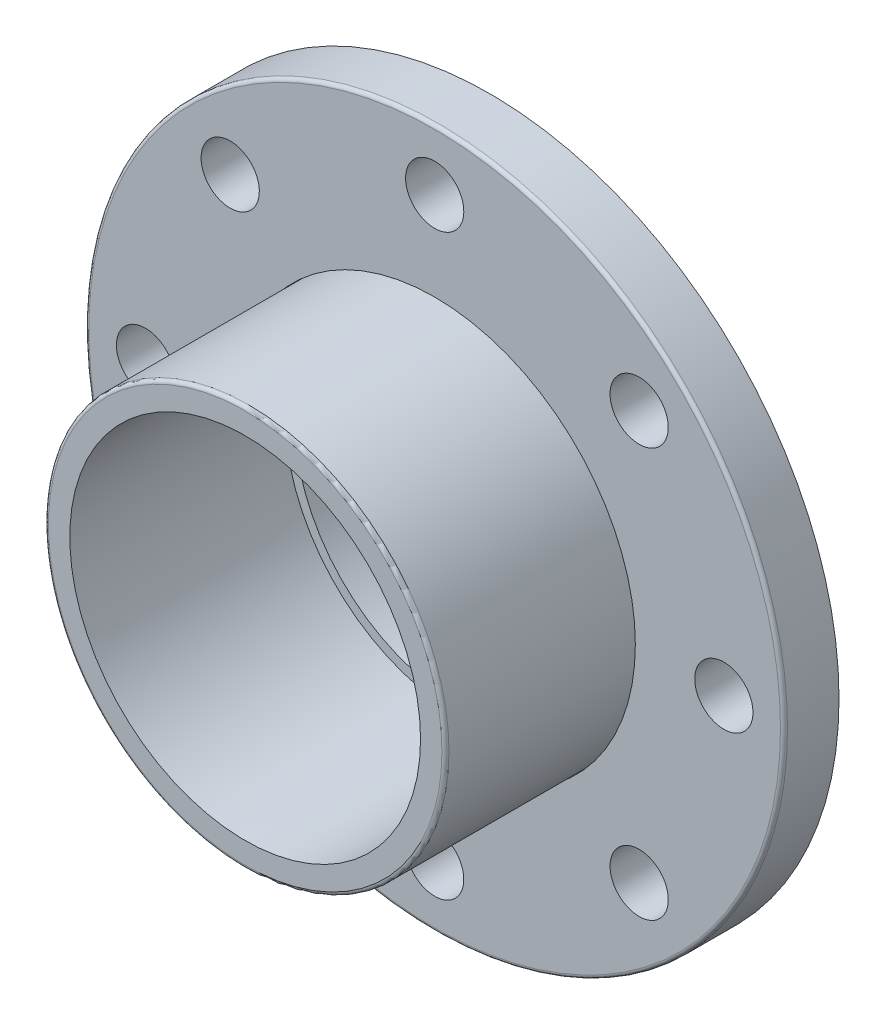
ISO-10303-21;
HEADER;
FILE_DESCRIPTION(('STEP AP214'),'2;1');
FILE_NAME('part.step','',(''),(''),'','','');
FILE_SCHEMA(('AUTOMOTIVE_DESIGN { 1 0 10303 214 1 1 1 1 }'));
ENDSEC;
DATA;
#1=APPLICATION_CONTEXT('core data for automotive mechanical design processes');
#2=APPLICATION_PROTOCOL_DEFINITION('international standard','automotive_design',2000,#1);
#3=PRODUCT_CONTEXT('',#1,'mechanical');
#4=PRODUCT('Part','Part','',(#3));
#5=PRODUCT_RELATED_PRODUCT_CATEGORY('part','',(#4));
#6=PRODUCT_DEFINITION_FORMATION('','',#4);
#7=PRODUCT_DEFINITION_CONTEXT('part definition',#1,'design');
#8=PRODUCT_DEFINITION('design','',#6,#7);
#9=PRODUCT_DEFINITION_SHAPE('','',#8);
#10=(LENGTH_UNIT() NAMED_UNIT(*) SI_UNIT(.MILLI.,.METRE.));
#11=(NAMED_UNIT(*) PLANE_ANGLE_UNIT() SI_UNIT($,.RADIAN.));
#12=(NAMED_UNIT(*) SI_UNIT($,.STERADIAN.) SOLID_ANGLE_UNIT());
#13=UNCERTAINTY_MEASURE_WITH_UNIT(LENGTH_MEASURE(1.E-05),#10,'distance_accuracy_value','');
#14=(GEOMETRIC_REPRESENTATION_CONTEXT(3) GLOBAL_UNCERTAINTY_ASSIGNED_CONTEXT((#13)) GLOBAL_UNIT_ASSIGNED_CONTEXT((#10,
#11,#12)) REPRESENTATION_CONTEXT('',''));
#15=CARTESIAN_POINT('',(0.,0.,0.));
#16=DIRECTION('',(0.,0.,1.));
#17=DIRECTION('',(1.,0.,0.));
#18=AXIS2_PLACEMENT_3D('',#15,#16,#17);
#19=CARTESIAN_POINT('',(0.,0.,0.));
#20=DIRECTION('',(0.,0.,-1.));
#21=DIRECTION('',(0.,1.,0.));
#22=AXIS2_PLACEMENT_3D('',#19,#20,#21);
#23=CYLINDRICAL_SURFACE('',#22,65.659);
#24=CARTESIAN_POINT('',(0.,0.,8.54972727272725));
#25=DIRECTION('',(0.,0.,-1.));
#26=DIRECTION('',(0.,1.,0.));
#27=AXIS2_PLACEMENT_3D('',#24,#25,#26);
#28=CIRCLE('',#27,65.659);
#29=CARTESIAN_POINT('',(0.,65.659,8.54972727272727));
#30=VERTEX_POINT('',#29);
#31=EDGE_CURVE('E65',#30,#30,#28,.T.);
#32=ORIENTED_EDGE('',*,*,#31,.T.);
#33=EDGE_LOOP('',(#32));
#34=FACE_BOUND('',#33,.T.);
#35=CARTESIAN_POINT('',(0.,0.,18.));
#36=DIRECTION('',(0.,0.,-1.));
#37=DIRECTION('',(0.,1.,0.));
#38=AXIS2_PLACEMENT_3D('',#35,#36,#37);
#39=CIRCLE('',#38,65.659);
#40=CARTESIAN_POINT('',(0.,65.659,18.));
#41=VERTEX_POINT('',#40);
#42=EDGE_CURVE('E60',#41,#41,#39,.T.);
#43=ORIENTED_EDGE('',*,*,#42,.F.);
#44=EDGE_LOOP('',(#43));
#45=FACE_BOUND('',#44,.T.);
#46=ADVANCED_FACE('F42',(#34,#45),#23,.F.);
#47=CARTESIAN_POINT('',(0.,65.532,8.54972727272727));
#48=DIRECTION('',(0.,0.,-1.));
#49=DIRECTION('',(0.,1.,0.));
#50=AXIS2_PLACEMENT_3D('',#47,#48,#49);
#51=PLANE('',#50);
#52=CARTESIAN_POINT('',(0.,0.,8.54972727272725));
#53=DIRECTION('',(0.,0.,-1.));
#54=DIRECTION('',(0.,1.,0.));
#55=AXIS2_PLACEMENT_3D('',#52,#53,#54);
#56=CIRCLE('',#55,75.057);
#57=CARTESIAN_POINT('',(0.,75.057,8.54972727272727));
#58=VERTEX_POINT('',#57);
#59=EDGE_CURVE('E67',#58,#58,#56,.T.);
#60=ORIENTED_EDGE('',*,*,#59,.T.);
#61=EDGE_LOOP('',(#60));
#62=FACE_BOUND('',#61,.T.);
#63=ORIENTED_EDGE('',*,*,#31,.F.);
#64=EDGE_LOOP('',(#63));
#65=FACE_BOUND('',#64,.T.);
#66=ADVANCED_FACE('F147',(#62,#65),#51,.T.);
#67=CARTESIAN_POINT('',(0.,0.,0.));
#68=DIRECTION('',(0.,0.,-1.));
#69=DIRECTION('',(0.,1.,0.));
#70=AXIS2_PLACEMENT_3D('',#67,#68,#69);
#71=CYLINDRICAL_SURFACE('',#70,75.057);
#72=CARTESIAN_POINT('',(0.,0.,0.));
#73=DIRECTION('',(0.,0.,-1.));
#74=DIRECTION('',(0.,1.,0.));
#75=AXIS2_PLACEMENT_3D('',#72,#73,#74);
#76=CIRCLE('',#75,75.057);
#77=CARTESIAN_POINT('',(0.,75.057,0.));
#78=VERTEX_POINT('',#77);
#79=EDGE_CURVE('E46',#78,#78,#76,.T.);
#80=ORIENTED_EDGE('',*,*,#79,.T.);
#81=EDGE_LOOP('',(#80));
#82=FACE_BOUND('',#81,.T.);
#83=ORIENTED_EDGE('',*,*,#59,.F.);
#84=EDGE_LOOP('',(#83));
#85=FACE_BOUND('',#84,.T.);
#86=ADVANCED_FACE('F133',(#82,#85),#71,.F.);
#87=CARTESIAN_POINT('',(0.,0.,16.8454545454545));
#88=DIRECTION('',(0.,0.,1.));
#89=DIRECTION('',(1.,0.,0.));
#90=AXIS2_PLACEMENT_3D('',#87,#88,#89);
#91=TOROIDAL_SURFACE('',#90,113.145454545455,1.15454545454545);
#92=CARTESIAN_POINT('',(0.,0.,16.8454545454545));
#93=DIRECTION('',(0.,0.,1.));
#94=DIRECTION('',(1.,0.,0.));
#95=AXIS2_PLACEMENT_3D('',#92,#93,#94);
#96=CIRCLE('',#95,114.3);
#97=CARTESIAN_POINT('',(114.3,0.,16.8454545454545));
#98=VERTEX_POINT('',#97);
#99=EDGE_CURVE('E118',#98,#98,#96,.F.);
#100=ORIENTED_EDGE('',*,*,#99,.F.);
#101=EDGE_LOOP('',(#100));
#102=FACE_BOUND('',#101,.T.);
#103=CARTESIAN_POINT('',(0.,0.,18.));
#104=DIRECTION('',(0.,0.,1.));
#105=DIRECTION('',(1.,0.,0.));
#106=AXIS2_PLACEMENT_3D('',#103,#104,#105);
#107=CIRCLE('',#106,113.145454545455);
#108=CARTESIAN_POINT('',(113.145454545455,0.,18.));
#109=VERTEX_POINT('',#108);
#110=EDGE_CURVE('E64',#109,#109,#107,.T.);
#111=ORIENTED_EDGE('',*,*,#110,.F.);
#112=EDGE_LOOP('',(#111));
#113=FACE_BOUND('',#112,.T.);
#114=ADVANCED_FACE('F129',(#102,#113),#91,.T.);
#115=CARTESIAN_POINT('',(66.9029081019644,66.902908101966,0.));
#116=DIRECTION('',(0.,0.,1.));
#117=DIRECTION('',(1.,0.,0.));
#118=AXIS2_PLACEMENT_3D('',#115,#116,#117);
#119=CYLINDRICAL_SURFACE('',#118,9.52500000000001);
#120=CARTESIAN_POINT('',(66.9029081019644,66.902908101966,0.));
#121=DIRECTION('',(0.,0.,1.));
#122=DIRECTION('',(0.707106781186556,-0.707106781186539,0.));
#123=AXIS2_PLACEMENT_3D('',#120,#121,#122);
#124=CIRCLE('',#123,9.52500000000001);
#125=CARTESIAN_POINT('',(73.6381001927663,60.1677160111642,0.));
#126=VERTEX_POINT('',#125);
#127=EDGE_CURVE('E11',#126,#126,#124,.T.);
#128=ORIENTED_EDGE('',*,*,#127,.F.);
#129=EDGE_LOOP('',(#128));
#130=FACE_BOUND('',#129,.T.);
#131=CARTESIAN_POINT('',(66.9029081019644,66.902908101966,18.));
#132=DIRECTION('',(0.,0.,1.));
#133=DIRECTION('',(0.707106781186556,-0.707106781186539,0.));
#134=AXIS2_PLACEMENT_3D('',#131,#132,#133);
#135=CIRCLE('',#134,9.52500000000001);
#136=CARTESIAN_POINT('',(73.6381001927663,60.1677160111642,18.));
#137=VERTEX_POINT('',#136);
#138=EDGE_CURVE('E59',#137,#137,#135,.T.);
#139=ORIENTED_EDGE('',*,*,#138,.T.);
#140=EDGE_LOOP('',(#139));
#141=FACE_BOUND('',#140,.T.);
#142=ADVANCED_FACE('F132',(#130,#141),#119,.F.);
#143=CARTESIAN_POINT('',(94.615,9.91039520623929E-13,0.));
#144=DIRECTION('',(0.,0.,1.));
#145=DIRECTION('',(1.,0.,0.));
#146=AXIS2_PLACEMENT_3D('',#143,#144,#145);
#147=CYLINDRICAL_SURFACE('',#146,9.52500000000001);
#148=CARTESIAN_POINT('',(94.615,9.91039520623929E-13,0.));
#149=DIRECTION('',(0.,0.,1.));
#150=DIRECTION('',(0.,-1.,0.));
#151=AXIS2_PLACEMENT_3D('',#148,#149,#150);
#152=CIRCLE('',#151,9.52500000000001);
#153=CARTESIAN_POINT('',(94.6150000000001,-9.52499999999902,0.));
#154=VERTEX_POINT('',#153);
#155=EDGE_CURVE('E50',#154,#154,#152,.T.);
#156=ORIENTED_EDGE('',*,*,#155,.F.);
#157=EDGE_LOOP('',(#156));
#158=FACE_BOUND('',#157,.T.);
#159=CARTESIAN_POINT('',(94.615,9.91039520623929E-13,18.));
#160=DIRECTION('',(0.,0.,1.));
#161=DIRECTION('',(0.,-1.,0.));
#162=AXIS2_PLACEMENT_3D('',#159,#160,#161);
#163=CIRCLE('',#162,9.52500000000001);
#164=CARTESIAN_POINT('',(94.6150000000001,-9.52499999999902,18.));
#165=VERTEX_POINT('',#164);
#166=EDGE_CURVE('E75',#165,#165,#163,.T.);
#167=ORIENTED_EDGE('',*,*,#166,.T.);
#168=EDGE_LOOP('',(#167));
#169=FACE_BOUND('',#168,.T.);
#170=ADVANCED_FACE('F172',(#158,#169),#147,.F.);
#171=CARTESIAN_POINT('',(66.9029081019658,-66.9029081019646,0.));
#172=DIRECTION('',(0.,0.,1.));
#173=DIRECTION('',(1.,0.,0.));
#174=AXIS2_PLACEMENT_3D('',#171,#172,#173);
#175=CYLINDRICAL_SURFACE('',#174,9.52500000000001);
#176=CARTESIAN_POINT('',(66.9029081019658,-66.9029081019646,0.));
#177=DIRECTION('',(0.,0.,1.));
#178=DIRECTION('',(-0.707106781186541,-0.707106781186554,0.));
#179=AXIS2_PLACEMENT_3D('',#176,#177,#178);
#180=CIRCLE('',#179,9.52500000000001);
#181=CARTESIAN_POINT('',(60.167716011164,-73.6381001927665,0.));
#182=VERTEX_POINT('',#181);
#183=EDGE_CURVE('E55',#182,#182,#180,.T.);
#184=ORIENTED_EDGE('',*,*,#183,.F.);
#185=EDGE_LOOP('',(#184));
#186=FACE_BOUND('',#185,.T.);
#187=CARTESIAN_POINT('',(66.9029081019658,-66.9029081019646,18.));
#188=DIRECTION('',(0.,0.,1.));
#189=DIRECTION('',(-0.707106781186541,-0.707106781186554,0.));
#190=AXIS2_PLACEMENT_3D('',#187,#188,#189);
#191=CIRCLE('',#190,9.52500000000001);
#192=CARTESIAN_POINT('',(60.167716011164,-73.6381001927665,18.));
#193=VERTEX_POINT('',#192);
#194=EDGE_CURVE('E79',#193,#193,#191,.T.);
#195=ORIENTED_EDGE('',*,*,#194,.T.);
#196=EDGE_LOOP('',(#195));
#197=FACE_BOUND('',#196,.T.);
#198=ADVANCED_FACE('F179',(#186,#197),#175,.F.);
#199=CARTESIAN_POINT('',(6.60693013749286E-13,-94.615,0.));
#200=DIRECTION('',(0.,0.,1.));
#201=DIRECTION('',(1.,0.,0.));
#202=AXIS2_PLACEMENT_3D('',#199,#200,#201);
#203=CYLINDRICAL_SURFACE('',#202,9.52500000000001);
#204=CARTESIAN_POINT('',(6.60693013749286E-13,-94.615,0.));
#205=DIRECTION('',(0.,0.,1.));
#206=DIRECTION('',(-1.,0.,0.));
#207=AXIS2_PLACEMENT_3D('',#204,#205,#206);
#208=CIRCLE('',#207,9.52500000000001);
#209=CARTESIAN_POINT('',(-9.52499999999935,-94.6150000000001,0.));
#210=VERTEX_POINT('',#209);
#211=EDGE_CURVE('E88',#210,#210,#208,.T.);
#212=ORIENTED_EDGE('',*,*,#211,.F.);
#213=EDGE_LOOP('',(#212));
#214=FACE_BOUND('',#213,.T.);
#215=CARTESIAN_POINT('',(6.60693013749286E-13,-94.615,18.));
#216=DIRECTION('',(0.,0.,1.));
#217=DIRECTION('',(-1.,0.,0.));
#218=AXIS2_PLACEMENT_3D('',#215,#216,#217);
#219=CIRCLE('',#218,9.52500000000001);
#220=CARTESIAN_POINT('',(-9.52499999999935,-94.6150000000001,18.));
#221=VERTEX_POINT('',#220);
#222=EDGE_CURVE('E84',#221,#221,#219,.T.);
#223=ORIENTED_EDGE('',*,*,#222,.T.);
#224=EDGE_LOOP('',(#223));
#225=FACE_BOUND('',#224,.T.);
#226=ADVANCED_FACE('F186',(#214,#225),#203,.F.);
#227=CARTESIAN_POINT('',(-66.9029081019649,-66.9029081019656,0.));
#228=DIRECTION('',(0.,0.,1.));
#229=DIRECTION('',(1.,0.,0.));
#230=AXIS2_PLACEMENT_3D('',#227,#228,#229);
#231=CYLINDRICAL_SURFACE('',#230,9.52500000000001);
#232=CARTESIAN_POINT('',(-66.9029081019649,-66.9029081019656,0.));
#233=DIRECTION('',(0.,0.,1.));
#234=DIRECTION('',(-0.707106781186551,0.707106781186544,0.));
#235=AXIS2_PLACEMENT_3D('',#232,#233,#234);
#236=CIRCLE('',#235,9.52500000000001);
#237=CARTESIAN_POINT('',(-73.6381001927668,-60.1677160111637,0.));
#238=VERTEX_POINT('',#237);
#239=EDGE_CURVE('E92',#238,#238,#236,.T.);
#240=ORIENTED_EDGE('',*,*,#239,.F.);
#241=EDGE_LOOP('',(#240));
#242=FACE_BOUND('',#241,.T.);
#243=CARTESIAN_POINT('',(-66.9029081019649,-66.9029081019656,18.));
#244=DIRECTION('',(0.,0.,1.));
#245=DIRECTION('',(-0.707106781186551,0.707106781186544,0.));
#246=AXIS2_PLACEMENT_3D('',#243,#244,#245);
#247=CIRCLE('',#246,9.52500000000001);
#248=CARTESIAN_POINT('',(-73.6381001927668,-60.1677160111637,18.));
#249=VERTEX_POINT('',#248);
#250=EDGE_CURVE('E95',#249,#249,#247,.T.);
#251=ORIENTED_EDGE('',*,*,#250,.T.);
#252=EDGE_LOOP('',(#251));
#253=FACE_BOUND('',#252,.T.);
#254=ADVANCED_FACE('F194',(#242,#253),#231,.F.);
#255=CARTESIAN_POINT('',(-94.615,-3.30346506874643E-13,0.));
#256=DIRECTION('',(0.,0.,1.));
#257=DIRECTION('',(1.,0.,0.));
#258=AXIS2_PLACEMENT_3D('',#255,#256,#257);
#259=CYLINDRICAL_SURFACE('',#258,9.52500000000001);
#260=CARTESIAN_POINT('',(-94.615,-3.30346506874643E-13,0.));
#261=DIRECTION('',(0.,0.,1.));
#262=DIRECTION('',(0.,1.,0.));
#263=AXIS2_PLACEMENT_3D('',#260,#261,#262);
#264=CIRCLE('',#263,9.52500000000001);
#265=CARTESIAN_POINT('',(-94.615,9.52499999999968,0.));
#266=VERTEX_POINT('',#265);
#267=EDGE_CURVE('E98',#266,#266,#264,.T.);
#268=ORIENTED_EDGE('',*,*,#267,.F.);
#269=EDGE_LOOP('',(#268));
#270=FACE_BOUND('',#269,.T.);
#271=CARTESIAN_POINT('',(-94.615,-3.30346506874643E-13,18.));
#272=DIRECTION('',(0.,0.,1.));
#273=DIRECTION('',(0.,1.,0.));
#274=AXIS2_PLACEMENT_3D('',#271,#272,#273);
#275=CIRCLE('',#274,9.52500000000001);
#276=CARTESIAN_POINT('',(-94.615,9.52499999999968,18.));
#277=VERTEX_POINT('',#276);
#278=EDGE_CURVE('E101',#277,#277,#275,.T.);
#279=ORIENTED_EDGE('',*,*,#278,.T.);
#280=EDGE_LOOP('',(#279));
#281=FACE_BOUND('',#280,.T.);
#282=ADVANCED_FACE('F202',(#270,#281),#259,.F.);
#283=CARTESIAN_POINT('',(-66.9029081019653,66.9029081019651,0.));
#284=DIRECTION('',(0.,0.,1.));
#285=DIRECTION('',(1.,0.,0.));
#286=AXIS2_PLACEMENT_3D('',#283,#284,#285);
#287=CYLINDRICAL_SURFACE('',#286,9.52500000000001);
#288=CARTESIAN_POINT('',(-66.9029081019653,66.9029081019651,0.));
#289=DIRECTION('',(0.,0.,1.));
#290=DIRECTION('',(0.707106781186546,0.707106781186549,0.));
#291=AXIS2_PLACEMENT_3D('',#288,#289,#290);
#292=CIRCLE('',#291,9.52500000000001);
#293=CARTESIAN_POINT('',(-60.1677160111635,73.638100192767,0.));
#294=VERTEX_POINT('',#293);
#295=EDGE_CURVE('E104',#294,#294,#292,.T.);
#296=ORIENTED_EDGE('',*,*,#295,.F.);
#297=EDGE_LOOP('',(#296));
#298=FACE_BOUND('',#297,.T.);
#299=CARTESIAN_POINT('',(-66.9029081019653,66.9029081019651,18.));
#300=DIRECTION('',(0.,0.,1.));
#301=DIRECTION('',(0.707106781186546,0.707106781186549,0.));
#302=AXIS2_PLACEMENT_3D('',#299,#300,#301);
#303=CIRCLE('',#302,9.52500000000001);
#304=CARTESIAN_POINT('',(-60.1677160111635,73.638100192767,18.));
#305=VERTEX_POINT('',#304);
#306=EDGE_CURVE('E107',#305,#305,#303,.T.);
#307=ORIENTED_EDGE('',*,*,#306,.T.);
#308=EDGE_LOOP('',(#307));
#309=FACE_BOUND('',#308,.T.);
#310=ADVANCED_FACE('F141',(#298,#309),#287,.F.);
#311=CARTESIAN_POINT('',(0.,0.,18.));
#312=DIRECTION('',(0.,0.,1.));
#313=DIRECTION('',(1.,0.,0.));
#314=AXIS2_PLACEMENT_3D('',#311,#312,#313);
#315=PLANE('',#314);
#316=CARTESIAN_POINT('',(0.,94.615,18.));
#317=DIRECTION('',(0.,0.,1.));
#318=DIRECTION('',(1.,0.,0.));
#319=AXIS2_PLACEMENT_3D('',#316,#317,#318);
#320=CIRCLE('',#319,9.52500000000001);
#321=CARTESIAN_POINT('',(9.52500000000001,94.615,18.));
#322=VERTEX_POINT('',#321);
#323=EDGE_CURVE('E63',#322,#322,#320,.T.);
#324=ORIENTED_EDGE('',*,*,#323,.F.);
#325=EDGE_LOOP('',(#324));
#326=FACE_BOUND('',#325,.T.);
#327=ORIENTED_EDGE('',*,*,#306,.F.);
#328=EDGE_LOOP('',(#327));
#329=FACE_BOUND('',#328,.T.);
#330=ORIENTED_EDGE('',*,*,#278,.F.);
#331=EDGE_LOOP('',(#330));
#332=FACE_BOUND('',#331,.T.);
#333=ORIENTED_EDGE('',*,*,#250,.F.);
#334=EDGE_LOOP('',(#333));
#335=FACE_BOUND('',#334,.T.);
#336=ORIENTED_EDGE('',*,*,#222,.F.);
#337=EDGE_LOOP('',(#336));
#338=FACE_BOUND('',#337,.T.);
#339=ORIENTED_EDGE('',*,*,#194,.F.);
#340=EDGE_LOOP('',(#339));
#341=FACE_BOUND('',#340,.T.);
#342=ORIENTED_EDGE('',*,*,#166,.F.);
#343=EDGE_LOOP('',(#342));
#344=FACE_BOUND('',#343,.T.);
#345=ORIENTED_EDGE('',*,*,#138,.F.);
#346=EDGE_LOOP('',(#345));
#347=FACE_BOUND('',#346,.T.);
#348=ORIENTED_EDGE('',*,*,#110,.T.);
#349=EDGE_LOOP('',(#348));
#350=FACE_BOUND('',#349,.T.);
#351=ORIENTED_EDGE('',*,*,#42,.T.);
#352=EDGE_LOOP('',(#351));
#353=FACE_BOUND('',#352,.T.);
#354=ADVANCED_FACE('F137',(#326,#329,#332,#335,#338,#341,#344,#347,#350,#353),#315,.T.);
#355=CARTESIAN_POINT('',(0.,94.615,0.));
#356=DIRECTION('',(0.,0.,1.));
#357=DIRECTION('',(1.,0.,0.));
#358=AXIS2_PLACEMENT_3D('',#355,#356,#357);
#359=CYLINDRICAL_SURFACE('',#358,9.52500000000001);
#360=CARTESIAN_POINT('',(0.,94.615,0.));
#361=DIRECTION('',(0.,0.,1.));
#362=DIRECTION('',(1.,0.,0.));
#363=AXIS2_PLACEMENT_3D('',#360,#361,#362);
#364=CIRCLE('',#363,9.52500000000001);
#365=CARTESIAN_POINT('',(9.52500000000001,94.615,0.));
#366=VERTEX_POINT('',#365);
#367=EDGE_CURVE('E110',#366,#366,#364,.T.);
#368=ORIENTED_EDGE('',*,*,#367,.F.);
#369=EDGE_LOOP('',(#368));
#370=FACE_BOUND('',#369,.T.);
#371=ORIENTED_EDGE('',*,*,#323,.T.);
#372=EDGE_LOOP('',(#371));
#373=FACE_BOUND('',#372,.T.);
#374=ADVANCED_FACE('F140',(#370,#373),#359,.F.);
#375=CARTESIAN_POINT('',(0.,0.,18.));
#376=DIRECTION('',(0.,0.,-1.));
#377=DIRECTION('',(-1.,0.,0.));
#378=AXIS2_PLACEMENT_3D('',#375,#376,#377);
#379=CYLINDRICAL_SURFACE('',#378,114.3);
#380=ORIENTED_EDGE('',*,*,#99,.T.);
#381=EDGE_LOOP('',(#380));
#382=FACE_BOUND('',#381,.T.);
#383=CARTESIAN_POINT('',(0.,0.,0.));
#384=DIRECTION('',(0.,0.,1.));
#385=DIRECTION('',(1.,0.,0.));
#386=AXIS2_PLACEMENT_3D('',#383,#384,#385);
#387=CIRCLE('',#386,114.3);
#388=CARTESIAN_POINT('',(114.3,0.,0.));
#389=VERTEX_POINT('',#388);
#390=EDGE_CURVE('E115',#389,#389,#387,.T.);
#391=ORIENTED_EDGE('',*,*,#390,.T.);
#392=EDGE_LOOP('',(#391));
#393=FACE_BOUND('',#392,.T.);
#394=ADVANCED_FACE('F126',(#382,#393),#379,.T.);
#395=CARTESIAN_POINT('',(0.,0.,0.));
#396=DIRECTION('',(0.,0.,1.));
#397=DIRECTION('',(1.,0.,0.));
#398=AXIS2_PLACEMENT_3D('',#395,#396,#397);
#399=PLANE('',#398);
#400=ORIENTED_EDGE('',*,*,#390,.F.);
#401=EDGE_LOOP('',(#400));
#402=FACE_BOUND('',#401,.T.);
#403=ORIENTED_EDGE('',*,*,#367,.T.);
#404=EDGE_LOOP('',(#403));
#405=FACE_BOUND('',#404,.T.);
#406=ORIENTED_EDGE('',*,*,#295,.T.);
#407=EDGE_LOOP('',(#406));
#408=FACE_BOUND('',#407,.T.);
#409=ORIENTED_EDGE('',*,*,#267,.T.);
#410=EDGE_LOOP('',(#409));
#411=FACE_BOUND('',#410,.T.);
#412=ORIENTED_EDGE('',*,*,#239,.T.);
#413=EDGE_LOOP('',(#412));
#414=FACE_BOUND('',#413,.T.);
#415=ORIENTED_EDGE('',*,*,#211,.T.);
#416=EDGE_LOOP('',(#415));
#417=FACE_BOUND('',#416,.T.);
#418=ORIENTED_EDGE('',*,*,#183,.T.);
#419=EDGE_LOOP('',(#418));
#420=FACE_BOUND('',#419,.T.);
#421=ORIENTED_EDGE('',*,*,#155,.T.);
#422=EDGE_LOOP('',(#421));
#423=FACE_BOUND('',#422,.T.);
#424=ORIENTED_EDGE('',*,*,#127,.T.);
#425=EDGE_LOOP('',(#424));
#426=FACE_BOUND('',#425,.T.);
#427=ORIENTED_EDGE('',*,*,#79,.F.);
#428=EDGE_LOOP('',(#427));
#429=FACE_BOUND('',#428,.T.);
#430=ADVANCED_FACE('F44',(#402,#405,#408,#411,#414,#417,#420,#423,#426,#429),#399,.F.);
#431=CLOSED_SHELL('',(#46,#66,#86,#114,#142,#170,#198,#226,#254,#282,#310,#354,#374,#394,#430));
#432=MANIFOLD_SOLID_BREP('B2',#431);
#433=CARTESIAN_POINT('',(0.,0.,0.));
#434=DIRECTION('',(0.,0.,1.));
#435=DIRECTION('',(1.,0.,0.));
#436=AXIS2_PLACEMENT_3D('',#433,#434,#435);
#437=PLANE('',#436);
#438=CARTESIAN_POINT('',(0.,0.,0.));
#439=DIRECTION('',(0.,0.,-1.));
#440=DIRECTION('',(0.,1.,0.));
#441=AXIS2_PLACEMENT_3D('',#438,#439,#440);
#442=CIRCLE('',#441,74.93);
#443=CARTESIAN_POINT('',(0.,74.93,0.));
#444=VERTEX_POINT('',#443);
#445=EDGE_CURVE('E374',#444,#444,#442,.T.);
#446=ORIENTED_EDGE('',*,*,#445,.T.);
#447=EDGE_LOOP('',(#446));
#448=FACE_BOUND('',#447,.T.);
#449=CARTESIAN_POINT('',(0.,0.,0.));
#450=DIRECTION('',(0.,0.,1.));
#451=DIRECTION('',(1.,0.,0.));
#452=AXIS2_PLACEMENT_3D('',#449,#450,#451);
#453=CIRCLE('',#452,53.848);
#454=CARTESIAN_POINT('',(53.848,0.,0.));
#455=VERTEX_POINT('',#454);
#456=EDGE_CURVE('E357',#455,#455,#453,.T.);
#457=ORIENTED_EDGE('',*,*,#456,.T.);
#458=EDGE_LOOP('',(#457));
#459=FACE_BOUND('',#458,.T.);
#460=ADVANCED_FACE('F342',(#448,#459),#437,.F.);
#461=CARTESIAN_POINT('',(0.,0.,80.));
#462=DIRECTION('',(0.,0.,-1.));
#463=DIRECTION('',(-1.,0.,0.));
#464=AXIS2_PLACEMENT_3D('',#461,#462,#463);
#465=CYLINDRICAL_SURFACE('',#464,65.532);
#466=CARTESIAN_POINT('',(0.,0.,78.8454545454546));
#467=DIRECTION('',(0.,0.,1.));
#468=DIRECTION('',(1.,0.,0.));
#469=AXIS2_PLACEMENT_3D('',#466,#467,#468);
#470=CIRCLE('',#469,65.532);
#471=CARTESIAN_POINT('',(65.532,0.,78.8454545454546));
#472=VERTEX_POINT('',#471);
#473=EDGE_CURVE('E41',#472,#472,#470,.F.);
#474=ORIENTED_EDGE('',*,*,#473,.T.);
#475=EDGE_LOOP('',(#474));
#476=FACE_BOUND('',#475,.T.);
#477=CARTESIAN_POINT('',(0.,0.,8.42272727272726));
#478=DIRECTION('',(0.,0.,-1.));
#479=DIRECTION('',(0.,1.,0.));
#480=AXIS2_PLACEMENT_3D('',#477,#478,#479);
#481=CIRCLE('',#480,65.532);
#482=CARTESIAN_POINT('',(0.,65.532,8.42272727272727));
#483=VERTEX_POINT('',#482);
#484=EDGE_CURVE('E371',#483,#483,#481,.T.);
#485=ORIENTED_EDGE('',*,*,#484,.F.);
#486=EDGE_LOOP('',(#485));
#487=FACE_BOUND('',#486,.T.);
#488=ADVANCED_FACE('F393',(#476,#487),#465,.T.);
#489=CARTESIAN_POINT('',(0.,0.,80.));
#490=DIRECTION('',(0.,0.,1.));
#491=DIRECTION('',(1.,0.,0.));
#492=AXIS2_PLACEMENT_3D('',#489,#490,#491);
#493=PLANE('',#492);
#494=CARTESIAN_POINT('',(0.,0.,80.));
#495=DIRECTION('',(0.,0.,1.));
#496=DIRECTION('',(1.,0.,0.));
#497=AXIS2_PLACEMENT_3D('',#494,#495,#496);
#498=CIRCLE('',#497,57.3786);
#499=CARTESIAN_POINT('',(57.3786,0.,80.));
#500=VERTEX_POINT('',#499);
#501=EDGE_CURVE('E362',#500,#500,#498,.T.);
#502=ORIENTED_EDGE('',*,*,#501,.F.);
#503=EDGE_LOOP('',(#502));
#504=FACE_BOUND('',#503,.T.);
#505=CARTESIAN_POINT('',(0.,0.,80.));
#506=DIRECTION('',(0.,0.,1.));
#507=DIRECTION('',(1.,0.,0.));
#508=AXIS2_PLACEMENT_3D('',#505,#506,#507);
#509=CIRCLE('',#508,64.3774545454545);
#510=CARTESIAN_POINT('',(64.3774545454545,0.,80.));
#511=VERTEX_POINT('',#510);
#512=EDGE_CURVE('E349',#511,#511,#509,.T.);
#513=ORIENTED_EDGE('',*,*,#512,.T.);
#514=EDGE_LOOP('',(#513));
#515=FACE_BOUND('',#514,.T.);
#516=ADVANCED_FACE('F395',(#504,#515),#493,.T.);
#517=CARTESIAN_POINT('',(0.,0.,78.8454545454546));
#518=DIRECTION('',(0.,0.,1.));
#519=DIRECTION('',(1.,0.,0.));
#520=AXIS2_PLACEMENT_3D('',#517,#518,#519);
#521=TOROIDAL_SURFACE('',#520,64.3774545454545,1.15454545454545);
#522=ORIENTED_EDGE('',*,*,#473,.F.);
#523=EDGE_LOOP('',(#522));
#524=FACE_BOUND('',#523,.T.);
#525=ORIENTED_EDGE('',*,*,#512,.F.);
#526=EDGE_LOOP('',(#525));
#527=FACE_BOUND('',#526,.T.);
#528=ADVANCED_FACE('F344',(#524,#527),#521,.T.);
#529=CARTESIAN_POINT('',(0.,53.848,10.));
#530=DIRECTION('',(0.,0.,-1.));
#531=DIRECTION('',(-1.,0.,0.));
#532=AXIS2_PLACEMENT_3D('',#529,#530,#531);
#533=PLANE('',#532);
#534=CARTESIAN_POINT('',(0.,0.,9.99999999999999));
#535=DIRECTION('',(0.,0.,1.));
#536=DIRECTION('',(1.,0.,0.));
#537=AXIS2_PLACEMENT_3D('',#534,#535,#536);
#538=CIRCLE('',#537,53.848);
#539=CARTESIAN_POINT('',(53.848,0.,9.99999999999999));
#540=VERTEX_POINT('',#539);
#541=EDGE_CURVE('E353',#540,#540,#538,.T.);
#542=ORIENTED_EDGE('',*,*,#541,.F.);
#543=EDGE_LOOP('',(#542));
#544=FACE_BOUND('',#543,.T.);
#545=CARTESIAN_POINT('',(0.,0.,9.99999999999999));
#546=DIRECTION('',(0.,0.,1.));
#547=DIRECTION('',(1.,0.,0.));
#548=AXIS2_PLACEMENT_3D('',#545,#546,#547);
#549=CIRCLE('',#548,57.0357);
#550=CARTESIAN_POINT('',(57.0357,0.,9.99999999999999));
#551=VERTEX_POINT('',#550);
#552=EDGE_CURVE('E365',#551,#551,#549,.T.);
#553=ORIENTED_EDGE('',*,*,#552,.T.);
#554=EDGE_LOOP('',(#553));
#555=FACE_BOUND('',#554,.T.);
#556=ADVANCED_FACE('F404',(#544,#555),#533,.F.);
#557=CARTESIAN_POINT('',(0.,0.,80.));
#558=DIRECTION('',(0.,0.,1.));
#559=DIRECTION('',(1.,0.,0.));
#560=AXIS2_PLACEMENT_3D('',#557,#558,#559);
#561=CYLINDRICAL_SURFACE('',#560,53.848);
#562=ORIENTED_EDGE('',*,*,#456,.F.);
#563=EDGE_LOOP('',(#562));
#564=FACE_BOUND('',#563,.T.);
#565=ORIENTED_EDGE('',*,*,#541,.T.);
#566=EDGE_LOOP('',(#565));
#567=FACE_BOUND('',#566,.T.);
#568=ADVANCED_FACE('F407',(#564,#567),#561,.F.);
#569=CARTESIAN_POINT('',(0.,0.,80.));
#570=DIRECTION('',(0.,0.,1.));
#571=DIRECTION('',(1.,0.,0.));
#572=AXIS2_PLACEMENT_3D('',#569,#570,#571);
#573=CONICAL_SURFACE('',#572,57.3786,0.00489853224709232);
#574=ORIENTED_EDGE('',*,*,#552,.F.);
#575=EDGE_LOOP('',(#574));
#576=FACE_BOUND('',#575,.T.);
#577=ORIENTED_EDGE('',*,*,#501,.T.);
#578=EDGE_LOOP('',(#577));
#579=FACE_BOUND('',#578,.T.);
#580=ADVANCED_FACE('F384',(#576,#579),#573,.F.);
#581=CARTESIAN_POINT('',(0.,0.,0.));
#582=DIRECTION('',(0.,0.,-1.));
#583=DIRECTION('',(0.,1.,0.));
#584=AXIS2_PLACEMENT_3D('',#581,#582,#583);
#585=CYLINDRICAL_SURFACE('',#584,74.93);
#586=ORIENTED_EDGE('',*,*,#445,.F.);
#587=EDGE_LOOP('',(#586));
#588=FACE_BOUND('',#587,.T.);
#589=CARTESIAN_POINT('',(0.,0.,8.42272727272726));
#590=DIRECTION('',(0.,0.,-1.));
#591=DIRECTION('',(0.,1.,0.));
#592=AXIS2_PLACEMENT_3D('',#589,#590,#591);
#593=CIRCLE('',#592,74.93);
#594=CARTESIAN_POINT('',(0.,74.93,8.42272727272727));
#595=VERTEX_POINT('',#594);
#596=EDGE_CURVE('E368',#595,#595,#593,.T.);
#597=ORIENTED_EDGE('',*,*,#596,.T.);
#598=EDGE_LOOP('',(#597));
#599=FACE_BOUND('',#598,.T.);
#600=ADVANCED_FACE('F380',(#588,#599),#585,.T.);
#601=CARTESIAN_POINT('',(0.,65.532,8.42272727272727));
#602=DIRECTION('',(0.,0.,-1.));
#603=DIRECTION('',(0.,1.,0.));
#604=AXIS2_PLACEMENT_3D('',#601,#602,#603);
#605=PLANE('',#604);
#606=ORIENTED_EDGE('',*,*,#596,.F.);
#607=EDGE_LOOP('',(#606));
#608=FACE_BOUND('',#607,.T.);
#609=ORIENTED_EDGE('',*,*,#484,.T.);
#610=EDGE_LOOP('',(#609));
#611=FACE_BOUND('',#610,.T.);
#612=ADVANCED_FACE('F383',(#608,#611),#605,.F.);
#613=CLOSED_SHELL('',(#460,#488,#516,#528,#556,#568,#580,#600,#612));
#614=MANIFOLD_SOLID_BREP('B6',#613);
#615=ADVANCED_BREP_SHAPE_REPRESENTATION('',(#18,#432,#614),#14);
#616=SHAPE_DEFINITION_REPRESENTATION(#9,#615);
ENDSEC;
END-ISO-10303-21;
